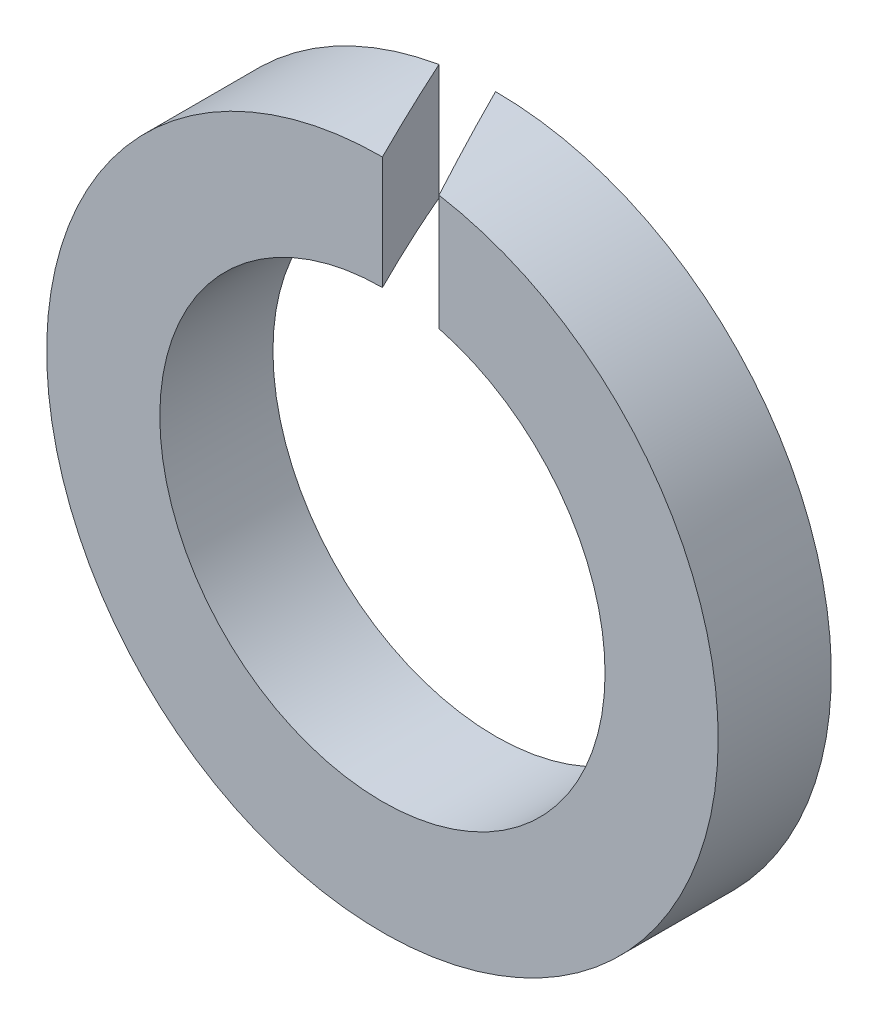
ISO-10303-21;
HEADER;
FILE_DESCRIPTION(('STEP AP214'),'2;1');
FILE_NAME('part.step','',(''),(''),'','','');
FILE_SCHEMA(('AUTOMOTIVE_DESIGN { 1 0 10303 214 1 1 1 1 }'));
ENDSEC;
DATA;
#1=APPLICATION_CONTEXT('core data for automotive mechanical design processes');
#2=APPLICATION_PROTOCOL_DEFINITION('international standard','automotive_design',2000,#1);
#3=PRODUCT_CONTEXT('',#1,'mechanical');
#4=PRODUCT('Part','Part','',(#3));
#5=PRODUCT_RELATED_PRODUCT_CATEGORY('part','',(#4));
#6=PRODUCT_DEFINITION_FORMATION('','',#4);
#7=PRODUCT_DEFINITION_CONTEXT('part definition',#1,'design');
#8=PRODUCT_DEFINITION('design','',#6,#7);
#9=PRODUCT_DEFINITION_SHAPE('','',#8);
#10=(LENGTH_UNIT() NAMED_UNIT(*) SI_UNIT(.MILLI.,.METRE.));
#11=(NAMED_UNIT(*) PLANE_ANGLE_UNIT() SI_UNIT($,.RADIAN.));
#12=(NAMED_UNIT(*) SI_UNIT($,.STERADIAN.) SOLID_ANGLE_UNIT());
#13=UNCERTAINTY_MEASURE_WITH_UNIT(LENGTH_MEASURE(1.E-05),#10,'distance_accuracy_value','');
#14=(GEOMETRIC_REPRESENTATION_CONTEXT(3) GLOBAL_UNCERTAINTY_ASSIGNED_CONTEXT((#13)) GLOBAL_UNIT_ASSIGNED_CONTEXT((#10,
#11,#12)) REPRESENTATION_CONTEXT('',''));
#15=CARTESIAN_POINT('',(0.,0.,0.));
#16=DIRECTION('',(0.,0.,1.));
#17=DIRECTION('',(1.,0.,0.));
#18=AXIS2_PLACEMENT_3D('',#15,#16,#17);
#19=CARTESIAN_POINT('',(0.,0.,3.1));
#20=DIRECTION('',(0.,0.,1.));
#21=DIRECTION('',(1.,0.,0.));
#22=AXIS2_PLACEMENT_3D('',#19,#20,#21);
#23=PLANE('',#22);
#24=CARTESIAN_POINT('',(0.,0.,3.1));
#25=DIRECTION('',(0.,0.,1.));
#26=DIRECTION('',(1.,0.,0.));
#27=AXIS2_PLACEMENT_3D('',#24,#25,#26);
#28=CIRCLE('',#27,6.1);
#29=CARTESIAN_POINT('',(1.55,5.89978813178914,3.1));
#30=VERTEX_POINT('',#29);
#31=CARTESIAN_POINT('',(0.,6.1,3.1));
#32=VERTEX_POINT('',#31);
#33=EDGE_CURVE('E67',#30,#32,#28,.F.);
#34=ORIENTED_EDGE('',*,*,#33,.T.);
#35=DIRECTION('',(0.,1.,0.));
#36=VECTOR('',#35,1.);
#37=CARTESIAN_POINT('',(0.,0.,3.1));
#38=LINE('',#37,#36);
#39=CARTESIAN_POINT('',(0.,9.2,3.1));
#40=VERTEX_POINT('',#39);
#41=EDGE_CURVE('E59',#32,#40,#38,.T.);
#42=ORIENTED_EDGE('',*,*,#41,.T.);
#43=CARTESIAN_POINT('',(0.,0.,3.1));
#44=DIRECTION('',(0.,0.,1.));
#45=DIRECTION('',(1.,0.,0.));
#46=AXIS2_PLACEMENT_3D('',#43,#44,#45);
#47=CIRCLE('',#46,9.2);
#48=CARTESIAN_POINT('',(1.55,9.0684894001151,3.1));
#49=VERTEX_POINT('',#48);
#50=EDGE_CURVE('E79',#49,#40,#47,.F.);
#51=ORIENTED_EDGE('',*,*,#50,.F.);
#52=DIRECTION('',(0.,1.,0.));
#53=VECTOR('',#52,1.);
#54=CARTESIAN_POINT('',(1.55,0.,3.1));
#55=LINE('',#54,#53);
#56=EDGE_CURVE('E72',#49,#30,#55,.F.);
#57=ORIENTED_EDGE('',*,*,#56,.T.);
#58=EDGE_LOOP('',(#34,#42,#51,#57));
#59=FACE_BOUND('',#58,.T.);
#60=ADVANCED_FACE('F17',(#59),#23,.T.);
#61=CARTESIAN_POINT('',(-1.55,0.,0.));
#62=DIRECTION('',(-0.894427190999916,0.,0.447213595499958));
#63=DIRECTION('',(0.447213595499958,0.,0.894427190999916));
#64=AXIS2_PLACEMENT_3D('',#61,#62,#63);
#65=PLANE('',#64);
#66=CARTESIAN_POINT('',(0.,0.,3.1));
#67=DIRECTION('',(-0.894427190999916,0.,0.447213595499958));
#68=DIRECTION('',(0.447213595499958,0.,0.894427190999916));
#69=AXIS2_PLACEMENT_3D('',#66,#67,#68);
#70=ELLIPSE('',#69,20.5718253929981,9.2);
#71=CARTESIAN_POINT('',(-1.55,9.06848940011511,0.));
#72=VERTEX_POINT('',#71);
#73=EDGE_CURVE('E20',#40,#72,#70,.T.);
#74=ORIENTED_EDGE('',*,*,#73,.F.);
#75=ORIENTED_EDGE('',*,*,#41,.F.);
#76=CARTESIAN_POINT('',(0.,0.,3.1));
#77=DIRECTION('',(-0.894427190999916,0.,0.447213595499958));
#78=DIRECTION('',(0.447213595499958,0.,0.894427190999916));
#79=AXIS2_PLACEMENT_3D('',#76,#77,#78);
#80=ELLIPSE('',#79,13.6400146627487,6.1);
#81=CARTESIAN_POINT('',(-1.55,5.89978813178914,0.));
#82=VERTEX_POINT('',#81);
#83=EDGE_CURVE('E62',#32,#82,#80,.T.);
#84=ORIENTED_EDGE('',*,*,#83,.T.);
#85=DIRECTION('',(0.,1.,0.));
#86=VECTOR('',#85,1.);
#87=CARTESIAN_POINT('',(-1.55,0.,0.));
#88=LINE('',#87,#86);
#89=EDGE_CURVE('E69',#82,#72,#88,.T.);
#90=ORIENTED_EDGE('',*,*,#89,.T.);
#91=EDGE_LOOP('',(#74,#75,#84,#90));
#92=FACE_BOUND('',#91,.T.);
#93=ADVANCED_FACE('F60',(#92),#65,.F.);
#94=CARTESIAN_POINT('',(0.,0.,0.));
#95=DIRECTION('',(0.,0.,1.));
#96=DIRECTION('',(1.,0.,0.));
#97=AXIS2_PLACEMENT_3D('',#94,#95,#96);
#98=CYLINDRICAL_SURFACE('',#97,9.2);
#99=CARTESIAN_POINT('',(0.,0.,0.));
#100=DIRECTION('',(0.,0.,1.));
#101=DIRECTION('',(1.,0.,0.));
#102=AXIS2_PLACEMENT_3D('',#99,#100,#101);
#103=CIRCLE('',#102,9.2);
#104=CARTESIAN_POINT('',(0.,9.2,0.));
#105=VERTEX_POINT('',#104);
#106=EDGE_CURVE('E89',#72,#105,#103,.T.);
#107=ORIENTED_EDGE('',*,*,#106,.T.);
#108=CARTESIAN_POINT('',(0.,0.,0.));
#109=DIRECTION('',(0.894427190999916,0.,-0.447213595499958));
#110=DIRECTION('',(0.447213595499958,0.,0.894427190999916));
#111=AXIS2_PLACEMENT_3D('',#108,#109,#110);
#112=ELLIPSE('',#111,20.5718253929981,9.2);
#113=EDGE_CURVE('E77',#105,#49,#112,.T.);
#114=ORIENTED_EDGE('',*,*,#113,.T.);
#115=ORIENTED_EDGE('',*,*,#50,.T.);
#116=ORIENTED_EDGE('',*,*,#73,.T.);
#117=EDGE_LOOP('',(#107,#114,#115,#116));
#118=FACE_BOUND('',#117,.T.);
#119=ADVANCED_FACE('F80',(#118),#98,.T.);
#120=CARTESIAN_POINT('',(1.55,0.,3.1));
#121=DIRECTION('',(0.894427190999916,0.,-0.447213595499958));
#122=DIRECTION('',(-0.447213595499958,0.,-0.894427190999916));
#123=AXIS2_PLACEMENT_3D('',#120,#121,#122);
#124=PLANE('',#123);
#125=CARTESIAN_POINT('',(0.,0.,0.));
#126=DIRECTION('',(0.894427190999916,0.,-0.447213595499958));
#127=DIRECTION('',(0.447213595499958,0.,0.894427190999916));
#128=AXIS2_PLACEMENT_3D('',#125,#126,#127);
#129=ELLIPSE('',#128,13.6400146627487,6.1);
#130=CARTESIAN_POINT('',(0.,6.1,0.));
#131=VERTEX_POINT('',#130);
#132=EDGE_CURVE('E34',#131,#30,#129,.T.);
#133=ORIENTED_EDGE('',*,*,#132,.T.);
#134=ORIENTED_EDGE('',*,*,#56,.F.);
#135=ORIENTED_EDGE('',*,*,#113,.F.);
#136=DIRECTION('',(0.,1.,0.));
#137=VECTOR('',#136,1.);
#138=CARTESIAN_POINT('',(0.,0.,0.));
#139=LINE('',#138,#137);
#140=EDGE_CURVE('E26',#105,#131,#139,.F.);
#141=ORIENTED_EDGE('',*,*,#140,.T.);
#142=EDGE_LOOP('',(#133,#134,#135,#141));
#143=FACE_BOUND('',#142,.T.);
#144=ADVANCED_FACE('F83',(#143),#124,.F.);
#145=CARTESIAN_POINT('',(0.,0.,0.));
#146=DIRECTION('',(0.,0.,1.));
#147=DIRECTION('',(1.,0.,0.));
#148=AXIS2_PLACEMENT_3D('',#145,#146,#147);
#149=CYLINDRICAL_SURFACE('',#148,6.1);
#150=CARTESIAN_POINT('',(0.,0.,0.));
#151=DIRECTION('',(0.,0.,1.));
#152=DIRECTION('',(1.,0.,0.));
#153=AXIS2_PLACEMENT_3D('',#150,#151,#152);
#154=CIRCLE('',#153,6.1);
#155=EDGE_CURVE('E11',#131,#82,#154,.F.);
#156=ORIENTED_EDGE('',*,*,#155,.T.);
#157=ORIENTED_EDGE('',*,*,#83,.F.);
#158=ORIENTED_EDGE('',*,*,#33,.F.);
#159=ORIENTED_EDGE('',*,*,#132,.F.);
#160=EDGE_LOOP('',(#156,#157,#158,#159));
#161=FACE_BOUND('',#160,.T.);
#162=ADVANCED_FACE('F66',(#161),#149,.F.);
#163=CARTESIAN_POINT('',(0.,0.,0.));
#164=DIRECTION('',(0.,0.,1.));
#165=DIRECTION('',(1.,0.,0.));
#166=AXIS2_PLACEMENT_3D('',#163,#164,#165);
#167=PLANE('',#166);
#168=ORIENTED_EDGE('',*,*,#155,.F.);
#169=ORIENTED_EDGE('',*,*,#140,.F.);
#170=ORIENTED_EDGE('',*,*,#106,.F.);
#171=ORIENTED_EDGE('',*,*,#89,.F.);
#172=EDGE_LOOP('',(#168,#169,#170,#171));
#173=FACE_BOUND('',#172,.T.);
#174=ADVANCED_FACE('F91',(#173),#167,.F.);
#175=CLOSED_SHELL('',(#60,#93,#119,#144,#162,#174));
#176=MANIFOLD_SOLID_BREP('B1',#175);
#177=ADVANCED_BREP_SHAPE_REPRESENTATION('',(#18,#176),#14);
#178=SHAPE_DEFINITION_REPRESENTATION(#9,#177);
ENDSEC;
END-ISO-10303-21;
